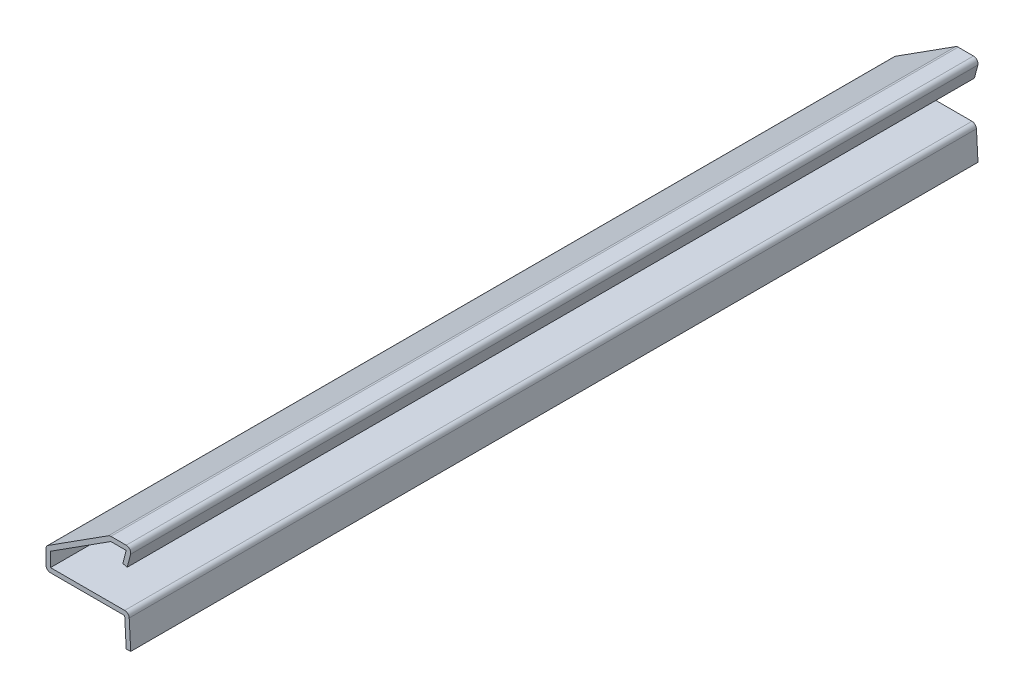
ISO-10303-21;
HEADER;
FILE_DESCRIPTION(('STEP AP214'),'2;1');
FILE_NAME('part.step','',(''),(''),'','','');
FILE_SCHEMA(('AUTOMOTIVE_DESIGN { 1 0 10303 214 1 1 1 1 }'));
ENDSEC;
DATA;
#1=APPLICATION_CONTEXT('core data for automotive mechanical design processes');
#2=APPLICATION_PROTOCOL_DEFINITION('international standard','automotive_design',2000,#1);
#3=PRODUCT_CONTEXT('',#1,'mechanical');
#4=PRODUCT('Part','Part','',(#3));
#5=PRODUCT_RELATED_PRODUCT_CATEGORY('part','',(#4));
#6=PRODUCT_DEFINITION_FORMATION('','',#4);
#7=PRODUCT_DEFINITION_CONTEXT('part definition',#1,'design');
#8=PRODUCT_DEFINITION('design','',#6,#7);
#9=PRODUCT_DEFINITION_SHAPE('','',#8);
#10=(LENGTH_UNIT() NAMED_UNIT(*) SI_UNIT(.MILLI.,.METRE.));
#11=(NAMED_UNIT(*) PLANE_ANGLE_UNIT() SI_UNIT($,.RADIAN.));
#12=(NAMED_UNIT(*) SI_UNIT($,.STERADIAN.) SOLID_ANGLE_UNIT());
#13=UNCERTAINTY_MEASURE_WITH_UNIT(LENGTH_MEASURE(1.E-05),#10,'distance_accuracy_value','');
#14=(GEOMETRIC_REPRESENTATION_CONTEXT(3) GLOBAL_UNCERTAINTY_ASSIGNED_CONTEXT((#13)) GLOBAL_UNIT_ASSIGNED_CONTEXT((#10,
#11,#12)) REPRESENTATION_CONTEXT('',''));
#15=CARTESIAN_POINT('',(0.,0.,0.));
#16=DIRECTION('',(0.,0.,1.));
#17=DIRECTION('',(1.,0.,0.));
#18=AXIS2_PLACEMENT_3D('',#15,#16,#17);
#19=CARTESIAN_POINT('',(-1.01450628516188,-0.0550726553476325,-190.5));
#20=DIRECTION('',(0.0542053694366462,-0.998529808230198,0.));
#21=DIRECTION('',(0.998529808230198,0.0542053694366462,0.));
#22=AXIS2_PLACEMENT_3D('',#19,#20,#21);
#23=PLANE('',#22);
#24=DIRECTION('',(0.998529808230199,0.0542053694366462,0.));
#25=VECTOR('',#24,1.);
#26=CARTESIAN_POINT('',(-1.01450628516188,-0.0550726553476325,0.));
#27=LINE('',#26,#25);
#28=CARTESIAN_POINT('',(-1.01450628516188,-0.0550726553476325,0.));
#29=VERTEX_POINT('',#28);
#30=CARTESIAN_POINT('',(0.,0.,0.));
#31=VERTEX_POINT('',#30);
#32=EDGE_CURVE('E232',#29,#31,#27,.T.);
#33=ORIENTED_EDGE('',*,*,#32,.F.);
#34=DIRECTION('',(0.,0.,1.));
#35=VECTOR('',#34,1.);
#36=CARTESIAN_POINT('',(-1.01450628516188,-0.0550726553476325,-190.5));
#37=LINE('',#36,#35);
#38=CARTESIAN_POINT('',(-1.01450628516188,-0.0550726553476325,-190.5));
#39=VERTEX_POINT('',#38);
#40=EDGE_CURVE('E193',#39,#29,#37,.T.);
#41=ORIENTED_EDGE('',*,*,#40,.F.);
#42=DIRECTION('',(0.998529808230199,0.0542053694366462,0.));
#43=VECTOR('',#42,1.);
#44=CARTESIAN_POINT('',(-1.01450628516188,-0.0550726553476325,-190.5));
#45=LINE('',#44,#43);
#46=CARTESIAN_POINT('',(0.,0.,-190.5));
#47=VERTEX_POINT('',#46);
#48=EDGE_CURVE('E187',#39,#47,#45,.T.);
#49=ORIENTED_EDGE('',*,*,#48,.T.);
#50=DIRECTION('',(0.,0.,1.));
#51=VECTOR('',#50,1.);
#52=CARTESIAN_POINT('',(0.,0.,-190.5));
#53=LINE('',#52,#51);
#54=EDGE_CURVE('E168',#47,#31,#53,.T.);
#55=ORIENTED_EDGE('',*,*,#54,.T.);
#56=EDGE_LOOP('',(#33,#41,#49,#55));
#57=FACE_BOUND('',#56,.T.);
#58=ADVANCED_FACE('F35',(#57),#23,.T.);
#59=CARTESIAN_POINT('',(-1.01450628516188,-0.0550726553476325,-190.5));
#60=DIRECTION('',(-0.998529808230198,-0.0542053694366462,0.));
#61=DIRECTION('',(0.0542053694366462,-0.998529808230198,0.));
#62=AXIS2_PLACEMENT_3D('',#59,#60,#61);
#63=PLANE('',#62);
#64=DIRECTION('',(0.0542053694366462,-0.998529808230198,0.));
#65=VECTOR('',#64,1.);
#66=CARTESIAN_POINT('',(-1.01450628516188,-0.0550726553476325,0.));
#67=LINE('',#66,#65);
#68=CARTESIAN_POINT('',(-1.35921717219366,6.29492734465237,0.));
#69=VERTEX_POINT('',#68);
#70=EDGE_CURVE('E194',#69,#29,#67,.T.);
#71=ORIENTED_EDGE('',*,*,#70,.F.);
#72=DIRECTION('',(0.,0.,1.));
#73=VECTOR('',#72,1.);
#74=CARTESIAN_POINT('',(-1.35921717219366,6.29492734465237,-190.5));
#75=LINE('',#74,#73);
#76=CARTESIAN_POINT('',(-1.35921717219366,6.29492734465237,-190.5));
#77=VERTEX_POINT('',#76);
#78=EDGE_CURVE('E270',#77,#69,#75,.T.);
#79=ORIENTED_EDGE('',*,*,#78,.F.);
#80=DIRECTION('',(0.0542053694366462,-0.998529808230198,0.));
#81=VECTOR('',#80,1.);
#82=CARTESIAN_POINT('',(-1.01450628516188,-0.0550726553476325,-190.5));
#83=LINE('',#82,#81);
#84=EDGE_CURVE('E181',#77,#39,#83,.T.);
#85=ORIENTED_EDGE('',*,*,#84,.T.);
#86=ORIENTED_EDGE('',*,*,#40,.T.);
#87=EDGE_LOOP('',(#71,#79,#85,#86));
#88=FACE_BOUND('',#87,.T.);
#89=ADVANCED_FACE('F367',(#88),#63,.T.);
#90=CARTESIAN_POINT('',(-1.35921717219366,6.29492734465237,-190.5));
#91=DIRECTION('',(0.,-1.,0.));
#92=DIRECTION('',(0.,0.,-1.));
#93=AXIS2_PLACEMENT_3D('',#90,#91,#92);
#94=PLANE('',#93);
#95=DIRECTION('',(1.,0.,0.));
#96=VECTOR('',#95,1.);
#97=CARTESIAN_POINT('',(-1.35921717219366,6.29492734465237,0.));
#98=LINE('',#97,#96);
#99=CARTESIAN_POINT('',(-18.034,6.29492734465237,0.));
#100=VERTEX_POINT('',#99);
#101=EDGE_CURVE('E197',#100,#69,#98,.T.);
#102=ORIENTED_EDGE('',*,*,#101,.F.);
#103=DIRECTION('',(0.,0.,1.));
#104=VECTOR('',#103,1.);
#105=CARTESIAN_POINT('',(-18.034,6.29492734465237,-190.5));
#106=LINE('',#105,#104);
#107=CARTESIAN_POINT('',(-18.034,6.29492734465237,-190.5));
#108=VERTEX_POINT('',#107);
#109=EDGE_CURVE('E310',#100,#108,#106,.F.);
#110=ORIENTED_EDGE('',*,*,#109,.T.);
#111=DIRECTION('',(1.,0.,0.));
#112=VECTOR('',#111,1.);
#113=CARTESIAN_POINT('',(-1.35921717219366,6.29492734465237,-190.5));
#114=LINE('',#113,#112);
#115=EDGE_CURVE('E229',#108,#77,#114,.T.);
#116=ORIENTED_EDGE('',*,*,#115,.T.);
#117=ORIENTED_EDGE('',*,*,#78,.T.);
#118=EDGE_LOOP('',(#102,#110,#116,#117));
#119=FACE_BOUND('',#118,.T.);
#120=ADVANCED_FACE('F378',(#119),#94,.T.);
#121=CARTESIAN_POINT('',(-19.05,6.29492734465237,-190.5));
#122=DIRECTION('',(-1.,0.,0.));
#123=DIRECTION('',(0.,0.,1.));
#124=AXIS2_PLACEMENT_3D('',#121,#122,#123);
#125=PLANE('',#124);
#126=DIRECTION('',(0.,-1.,0.));
#127=VECTOR('',#126,1.);
#128=CARTESIAN_POINT('',(-19.05,6.29492734465237,-190.5));
#129=LINE('',#128,#127);
#130=CARTESIAN_POINT('',(-19.05,10.5008845939242,-190.5));
#131=VERTEX_POINT('',#130);
#132=CARTESIAN_POINT('',(-19.05,7.31092734465237,-190.5));
#133=VERTEX_POINT('',#132);
#134=EDGE_CURVE('E226',#131,#133,#129,.T.);
#135=ORIENTED_EDGE('',*,*,#134,.T.);
#136=DIRECTION('',(0.,0.,1.));
#137=VECTOR('',#136,1.);
#138=CARTESIAN_POINT('',(-19.05,7.31092734465237,-190.5));
#139=LINE('',#138,#137);
#140=CARTESIAN_POINT('',(-19.05,7.31092734465237,0.));
#141=VERTEX_POINT('',#140);
#142=EDGE_CURVE('E307',#133,#141,#139,.T.);
#143=ORIENTED_EDGE('',*,*,#142,.T.);
#144=DIRECTION('',(0.,-1.,0.));
#145=VECTOR('',#144,1.);
#146=CARTESIAN_POINT('',(-19.05,6.29492734465237,0.));
#147=LINE('',#146,#145);
#148=CARTESIAN_POINT('',(-19.05,10.5008845939242,0.));
#149=VERTEX_POINT('',#148);
#150=EDGE_CURVE('E264',#149,#141,#147,.T.);
#151=ORIENTED_EDGE('',*,*,#150,.F.);
#152=DIRECTION('',(0.,0.,1.));
#153=VECTOR('',#152,1.);
#154=CARTESIAN_POINT('',(-19.05,10.5008845939242,-190.5));
#155=LINE('',#154,#153);
#156=EDGE_CURVE('E305',#149,#131,#155,.F.);
#157=ORIENTED_EDGE('',*,*,#156,.T.);
#158=EDGE_LOOP('',(#135,#143,#151,#157));
#159=FACE_BOUND('',#158,.T.);
#160=ADVANCED_FACE('F376',(#159),#125,.T.);
#161=CARTESIAN_POINT('',(-19.05,11.0574273446524,-190.5));
#162=DIRECTION('',(-0.538389277102201,0.84269625981214,0.));
#163=DIRECTION('',(-0.84269625981214,-0.538389277102201,0.));
#164=AXIS2_PLACEMENT_3D('',#161,#162,#163);
#165=PLANE('',#164);
#166=DIRECTION('',(-0.84269625981214,-0.538389277102201,0.));
#167=VECTOR('',#166,1.);
#168=CARTESIAN_POINT('',(-19.05,11.0574273446524,-190.5));
#169=LINE('',#168,#167);
#170=CARTESIAN_POINT('',(-5.01265398265701,20.0257317446215,-190.5));
#171=VERTEX_POINT('',#170);
#172=CARTESIAN_POINT('',(-18.5810035055358,11.3570639938934,-190.5));
#173=VERTEX_POINT('',#172);
#174=EDGE_CURVE('E224',#171,#173,#169,.T.);
#175=ORIENTED_EDGE('',*,*,#174,.T.);
#176=DIRECTION('',(0.,0.,1.));
#177=VECTOR('',#176,1.);
#178=CARTESIAN_POINT('',(-18.5810035055358,11.3570639938934,-190.5));
#179=LINE('',#178,#177);
#180=CARTESIAN_POINT('',(-18.5810035055358,11.3570639938934,0.));
#181=VERTEX_POINT('',#180);
#182=EDGE_CURVE('E43',#173,#181,#179,.T.);
#183=ORIENTED_EDGE('',*,*,#182,.T.);
#184=DIRECTION('',(-0.84269625981214,-0.538389277102201,0.));
#185=VECTOR('',#184,1.);
#186=CARTESIAN_POINT('',(-19.05,11.0574273446524,0.));
#187=LINE('',#186,#185);
#188=CARTESIAN_POINT('',(-5.01265398265701,20.0257317446215,0.));
#189=VERTEX_POINT('',#188);
#190=EDGE_CURVE('E261',#189,#181,#187,.T.);
#191=ORIENTED_EDGE('',*,*,#190,.F.);
#192=DIRECTION('',(0.,0.,1.));
#193=VECTOR('',#192,1.);
#194=CARTESIAN_POINT('',(-5.012653982657,20.0257317446215,-190.5));
#195=LINE('',#194,#193);
#196=EDGE_CURVE('E312',#189,#171,#195,.F.);
#197=ORIENTED_EDGE('',*,*,#196,.T.);
#198=EDGE_LOOP('',(#175,#183,#191,#197));
#199=FACE_BOUND('',#198,.T.);
#200=ADVANCED_FACE('F317',(#199),#165,.T.);
#201=CARTESIAN_POINT('',(-4.7625,20.1855523446524,-190.5));
#202=DIRECTION('',(0.,1.,0.));
#203=DIRECTION('',(-1.,0.,0.));
#204=AXIS2_PLACEMENT_3D('',#201,#202,#203);
#205=PLANE('',#204);
#206=DIRECTION('',(-1.,0.,0.));
#207=VECTOR('',#206,1.);
#208=CARTESIAN_POINT('',(-4.7625,20.1855523446524,-190.5));
#209=LINE('',#208,#207);
#210=CARTESIAN_POINT('',(-1.016,20.1855523446524,-190.5));
#211=VERTEX_POINT('',#210);
#212=CARTESIAN_POINT('',(-4.46565047712117,20.1855523446524,-190.5));
#213=VERTEX_POINT('',#212);
#214=EDGE_CURVE('E222',#211,#213,#209,.T.);
#215=ORIENTED_EDGE('',*,*,#214,.T.);
#216=DIRECTION('',(0.,0.,1.));
#217=VECTOR('',#216,1.);
#218=CARTESIAN_POINT('',(-4.46565047712117,20.1855523446524,-190.5));
#219=LINE('',#218,#217);
#220=CARTESIAN_POINT('',(-4.46565047712117,20.1855523446524,0.));
#221=VERTEX_POINT('',#220);
#222=EDGE_CURVE('E11',#213,#221,#219,.T.);
#223=ORIENTED_EDGE('',*,*,#222,.T.);
#224=DIRECTION('',(-1.,0.,0.));
#225=VECTOR('',#224,1.);
#226=CARTESIAN_POINT('',(-4.7625,20.1855523446524,0.));
#227=LINE('',#226,#225);
#228=CARTESIAN_POINT('',(-1.016,20.1855523446524,0.));
#229=VERTEX_POINT('',#228);
#230=EDGE_CURVE('E258',#229,#221,#227,.T.);
#231=ORIENTED_EDGE('',*,*,#230,.F.);
#232=DIRECTION('',(0.,0.,1.));
#233=VECTOR('',#232,1.);
#234=CARTESIAN_POINT('',(-1.016,20.1855523446524,-190.5));
#235=LINE('',#234,#233);
#236=EDGE_CURVE('E273',#211,#229,#235,.T.);
#237=ORIENTED_EDGE('',*,*,#236,.F.);
#238=EDGE_LOOP('',(#215,#223,#231,#237));
#239=FACE_BOUND('',#238,.T.);
#240=ADVANCED_FACE('F327',(#239),#205,.T.);
#241=CARTESIAN_POINT('',(-1.016,19.1695523446524,-190.5));
#242=DIRECTION('',(0.,0.,1.));
#243=DIRECTION('',(1.,0.,0.));
#244=AXIS2_PLACEMENT_3D('',#241,#242,#243);
#245=CYLINDRICAL_SURFACE('',#244,1.016);
#246=CARTESIAN_POINT('',(-1.016,19.1695523446524,0.));
#247=DIRECTION('',(0.,0.,1.));
#248=DIRECTION('',(-1.,0.,0.));
#249=AXIS2_PLACEMENT_3D('',#246,#247,#248);
#250=CIRCLE('',#249,1.016);
#251=CARTESIAN_POINT('',(-0.0328589909443715,18.9132522152863,0.));
#252=VERTEX_POINT('',#251);
#253=EDGE_CURVE('E255',#252,#229,#250,.T.);
#254=ORIENTED_EDGE('',*,*,#253,.F.);
#255=DIRECTION('',(0.,0.,1.));
#256=VECTOR('',#255,1.);
#257=CARTESIAN_POINT('',(-0.0328589909443715,18.9132522152863,-190.5));
#258=LINE('',#257,#256);
#259=CARTESIAN_POINT('',(-0.0328589909443715,18.9132522152863,-190.5));
#260=VERTEX_POINT('',#259);
#261=EDGE_CURVE('E275',#260,#252,#258,.T.);
#262=ORIENTED_EDGE('',*,*,#261,.F.);
#263=CARTESIAN_POINT('',(-1.016,19.1695523446524,-190.5));
#264=DIRECTION('',(0.,0.,1.));
#265=DIRECTION('',(-1.,0.,0.));
#266=AXIS2_PLACEMENT_3D('',#263,#264,#265);
#267=CIRCLE('',#266,1.016);
#268=EDGE_CURVE('E219',#260,#211,#267,.T.);
#269=ORIENTED_EDGE('',*,*,#268,.T.);
#270=ORIENTED_EDGE('',*,*,#236,.T.);
#271=EDGE_LOOP('',(#254,#262,#269,#270));
#272=FACE_BOUND('',#271,.T.);
#273=ADVANCED_FACE('F332',(#272),#245,.T.);
#274=CARTESIAN_POINT('',(-0.0328589909443736,18.9132522152863,-190.5));
#275=DIRECTION('',(0.967658473479948,-0.252263906856403,0.));
#276=DIRECTION('',(0.252263906856403,0.967658473479948,0.));
#277=AXIS2_PLACEMENT_3D('',#274,#275,#276);
#278=PLANE('',#277);
#279=DIRECTION('',(0.252263906856403,0.967658473479948,0.));
#280=VECTOR('',#279,1.);
#281=CARTESIAN_POINT('',(-0.0328589909443736,18.9132522152863,0.));
#282=LINE('',#281,#280);
#283=CARTESIAN_POINT('',(-0.79375,15.9945523446524,0.));
#284=VERTEX_POINT('',#283);
#285=EDGE_CURVE('E252',#284,#252,#282,.T.);
#286=ORIENTED_EDGE('',*,*,#285,.F.);
#287=DIRECTION('',(0.,0.,1.));
#288=VECTOR('',#287,1.);
#289=CARTESIAN_POINT('',(-0.79375,15.9945523446524,-190.5));
#290=LINE('',#289,#288);
#291=CARTESIAN_POINT('',(-0.79375,15.9945523446524,-190.5));
#292=VERTEX_POINT('',#291);
#293=EDGE_CURVE('E277',#292,#284,#290,.T.);
#294=ORIENTED_EDGE('',*,*,#293,.F.);
#295=DIRECTION('',(0.252263906856403,0.967658473479948,0.));
#296=VECTOR('',#295,1.);
#297=CARTESIAN_POINT('',(-0.0328589909443736,18.9132522152863,-190.5));
#298=LINE('',#297,#296);
#299=EDGE_CURVE('E216',#292,#260,#298,.T.);
#300=ORIENTED_EDGE('',*,*,#299,.T.);
#301=ORIENTED_EDGE('',*,*,#261,.T.);
#302=EDGE_LOOP('',(#286,#294,#300,#301));
#303=FACE_BOUND('',#302,.T.);
#304=ADVANCED_FACE('F335',(#303),#278,.T.);
#305=CARTESIAN_POINT('',(-0.79375,15.9945523446524,-190.5));
#306=DIRECTION('',(-0.252263906856403,-0.967658473479948,0.));
#307=DIRECTION('',(0.967658473479948,-0.252263906856403,0.));
#308=AXIS2_PLACEMENT_3D('',#305,#306,#307);
#309=PLANE('',#308);
#310=DIRECTION('',(0.967658473479948,-0.252263906856403,0.));
#311=VECTOR('',#310,1.);
#312=CARTESIAN_POINT('',(-0.79375,15.9945523446524,0.));
#313=LINE('',#312,#311);
#314=CARTESIAN_POINT('',(-1.77689100905563,16.2508524740185,0.));
#315=VERTEX_POINT('',#314);
#316=EDGE_CURVE('E249',#315,#284,#313,.T.);
#317=ORIENTED_EDGE('',*,*,#316,.F.);
#318=DIRECTION('',(0.,0.,1.));
#319=VECTOR('',#318,1.);
#320=CARTESIAN_POINT('',(-1.77689100905563,16.2508524740185,-190.5));
#321=LINE('',#320,#319);
#322=CARTESIAN_POINT('',(-1.77689100905563,16.2508524740185,-190.5));
#323=VERTEX_POINT('',#322);
#324=EDGE_CURVE('E279',#323,#315,#321,.T.);
#325=ORIENTED_EDGE('',*,*,#324,.F.);
#326=DIRECTION('',(0.967658473479948,-0.252263906856403,0.));
#327=VECTOR('',#326,1.);
#328=CARTESIAN_POINT('',(-0.79375,15.9945523446524,-190.5));
#329=LINE('',#328,#327);
#330=EDGE_CURVE('E213',#323,#292,#329,.T.);
#331=ORIENTED_EDGE('',*,*,#330,.T.);
#332=ORIENTED_EDGE('',*,*,#293,.T.);
#333=EDGE_LOOP('',(#317,#325,#331,#332));
#334=FACE_BOUND('',#333,.T.);
#335=ADVANCED_FACE('F340',(#334),#309,.T.);
#336=CARTESIAN_POINT('',(-1.016,19.1695523446524,-190.5));
#337=DIRECTION('',(-0.967658473479949,0.252263906856402,0.));
#338=DIRECTION('',(-0.252263906856402,-0.967658473479949,0.));
#339=AXIS2_PLACEMENT_3D('',#336,#337,#338);
#340=PLANE('',#339);
#341=DIRECTION('',(-0.252263906856402,-0.967658473479949,0.));
#342=VECTOR('',#341,1.);
#343=CARTESIAN_POINT('',(-1.016,19.1695523446524,0.));
#344=LINE('',#343,#342);
#345=CARTESIAN_POINT('',(-1.016,19.1695523446524,0.));
#346=VERTEX_POINT('',#345);
#347=EDGE_CURVE('E246',#346,#315,#344,.T.);
#348=ORIENTED_EDGE('',*,*,#347,.F.);
#349=DIRECTION('',(0.,0.,1.));
#350=VECTOR('',#349,1.);
#351=CARTESIAN_POINT('',(-1.016,19.1695523446524,-190.5));
#352=LINE('',#351,#350);
#353=CARTESIAN_POINT('',(-1.016,19.1695523446524,-190.5));
#354=VERTEX_POINT('',#353);
#355=EDGE_CURVE('E281',#354,#346,#352,.T.);
#356=ORIENTED_EDGE('',*,*,#355,.F.);
#357=DIRECTION('',(-0.252263906856402,-0.967658473479949,0.));
#358=VECTOR('',#357,1.);
#359=CARTESIAN_POINT('',(-1.016,19.1695523446524,-190.5));
#360=LINE('',#359,#358);
#361=EDGE_CURVE('E210',#354,#323,#360,.T.);
#362=ORIENTED_EDGE('',*,*,#361,.T.);
#363=ORIENTED_EDGE('',*,*,#324,.T.);
#364=EDGE_LOOP('',(#348,#356,#362,#363));
#365=FACE_BOUND('',#364,.T.);
#366=ADVANCED_FACE('F343',(#365),#340,.T.);
#367=CARTESIAN_POINT('',(-4.46565047712117,19.1695523446524,-190.5));
#368=DIRECTION('',(0.,-1.,0.));
#369=DIRECTION('',(0.,0.,-1.));
#370=AXIS2_PLACEMENT_3D('',#367,#368,#369);
#371=PLANE('',#370);
#372=DIRECTION('',(1.,0.,0.));
#373=VECTOR('',#372,1.);
#374=CARTESIAN_POINT('',(-4.46565047712117,19.1695523446524,0.));
#375=LINE('',#374,#373);
#376=CARTESIAN_POINT('',(-4.46565047712117,19.1695523446524,0.));
#377=VERTEX_POINT('',#376);
#378=EDGE_CURVE('E243',#377,#346,#375,.T.);
#379=ORIENTED_EDGE('',*,*,#378,.F.);
#380=DIRECTION('',(0.,0.,1.));
#381=VECTOR('',#380,1.);
#382=CARTESIAN_POINT('',(-4.46565047712117,19.1695523446524,-190.5));
#383=LINE('',#382,#381);
#384=CARTESIAN_POINT('',(-4.46565047712117,19.1695523446524,-190.5));
#385=VERTEX_POINT('',#384);
#386=EDGE_CURVE('E283',#385,#377,#383,.T.);
#387=ORIENTED_EDGE('',*,*,#386,.F.);
#388=DIRECTION('',(1.,0.,0.));
#389=VECTOR('',#388,1.);
#390=CARTESIAN_POINT('',(-4.46565047712117,19.1695523446524,-190.5));
#391=LINE('',#390,#389);
#392=EDGE_CURVE('E207',#385,#354,#391,.T.);
#393=ORIENTED_EDGE('',*,*,#392,.T.);
#394=ORIENTED_EDGE('',*,*,#355,.T.);
#395=EDGE_LOOP('',(#379,#387,#393,#394));
#396=FACE_BOUND('',#395,.T.);
#397=ADVANCED_FACE('F348',(#396),#371,.T.);
#398=CARTESIAN_POINT('',(-18.034,10.5008845939242,-190.5));
#399=DIRECTION('',(0.538389277102201,-0.84269625981214,0.));
#400=DIRECTION('',(0.84269625981214,0.538389277102201,0.));
#401=AXIS2_PLACEMENT_3D('',#398,#399,#400);
#402=PLANE('',#401);
#403=DIRECTION('',(0.84269625981214,0.538389277102201,0.));
#404=VECTOR('',#403,1.);
#405=CARTESIAN_POINT('',(-18.034,10.5008845939242,0.));
#406=LINE('',#405,#404);
#407=CARTESIAN_POINT('',(-18.034,10.5008845939242,0.));
#408=VERTEX_POINT('',#407);
#409=EDGE_CURVE('E240',#408,#377,#406,.T.);
#410=ORIENTED_EDGE('',*,*,#409,.F.);
#411=DIRECTION('',(0.,0.,1.));
#412=VECTOR('',#411,1.);
#413=CARTESIAN_POINT('',(-18.034,10.5008845939242,-190.5));
#414=LINE('',#413,#412);
#415=CARTESIAN_POINT('',(-18.034,10.5008845939242,-190.5));
#416=VERTEX_POINT('',#415);
#417=EDGE_CURVE('E285',#416,#408,#414,.T.);
#418=ORIENTED_EDGE('',*,*,#417,.F.);
#419=DIRECTION('',(0.84269625981214,0.538389277102201,0.));
#420=VECTOR('',#419,1.);
#421=CARTESIAN_POINT('',(-18.034,10.5008845939242,-190.5));
#422=LINE('',#421,#420);
#423=EDGE_CURVE('E204',#416,#385,#422,.T.);
#424=ORIENTED_EDGE('',*,*,#423,.T.);
#425=ORIENTED_EDGE('',*,*,#386,.T.);
#426=EDGE_LOOP('',(#410,#418,#424,#425));
#427=FACE_BOUND('',#426,.T.);
#428=ADVANCED_FACE('F351',(#427),#402,.T.);
#429=CARTESIAN_POINT('',(-18.034,7.31092734465237,-190.5));
#430=DIRECTION('',(1.,0.,0.));
#431=DIRECTION('',(0.,0.,-1.));
#432=AXIS2_PLACEMENT_3D('',#429,#430,#431);
#433=PLANE('',#432);
#434=DIRECTION('',(0.,1.,0.));
#435=VECTOR('',#434,1.);
#436=CARTESIAN_POINT('',(-18.034,7.31092734465237,0.));
#437=LINE('',#436,#435);
#438=CARTESIAN_POINT('',(-18.034,7.31092734465237,0.));
#439=VERTEX_POINT('',#438);
#440=EDGE_CURVE('E237',#439,#408,#437,.T.);
#441=ORIENTED_EDGE('',*,*,#440,.F.);
#442=DIRECTION('',(0.,0.,1.));
#443=VECTOR('',#442,1.);
#444=CARTESIAN_POINT('',(-18.034,7.31092734465237,-190.5));
#445=LINE('',#444,#443);
#446=CARTESIAN_POINT('',(-18.034,7.31092734465237,-190.5));
#447=VERTEX_POINT('',#446);
#448=EDGE_CURVE('E180',#447,#439,#445,.T.);
#449=ORIENTED_EDGE('',*,*,#448,.F.);
#450=DIRECTION('',(0.,1.,0.));
#451=VECTOR('',#450,1.);
#452=CARTESIAN_POINT('',(-18.034,7.31092734465237,-190.5));
#453=LINE('',#452,#451);
#454=EDGE_CURVE('E201',#447,#416,#453,.T.);
#455=ORIENTED_EDGE('',*,*,#454,.T.);
#456=ORIENTED_EDGE('',*,*,#417,.T.);
#457=EDGE_LOOP('',(#441,#449,#455,#456));
#458=FACE_BOUND('',#457,.T.);
#459=ADVANCED_FACE('F356',(#458),#433,.T.);
#460=CARTESIAN_POINT('',(-0.396875,7.31092734465237,-190.5));
#461=DIRECTION('',(0.,1.,0.));
#462=DIRECTION('',(0.,0.,1.));
#463=AXIS2_PLACEMENT_3D('',#460,#461,#462);
#464=PLANE('',#463);
#465=DIRECTION('',(-1.,0.,0.));
#466=VECTOR('',#465,1.);
#467=CARTESIAN_POINT('',(-0.396875,7.31092734465237,0.));
#468=LINE('',#467,#466);
#469=CARTESIAN_POINT('',(-1.35921717219366,7.31092734465237,0.));
#470=VERTEX_POINT('',#469);
#471=EDGE_CURVE('E235',#470,#439,#468,.T.);
#472=ORIENTED_EDGE('',*,*,#471,.F.);
#473=DIRECTION('',(0.,0.,1.));
#474=VECTOR('',#473,1.);
#475=CARTESIAN_POINT('',(-1.35921717219366,7.31092734465237,-190.5));
#476=LINE('',#475,#474);
#477=CARTESIAN_POINT('',(-1.35921717219366,7.31092734465237,-190.5));
#478=VERTEX_POINT('',#477);
#479=EDGE_CURVE('E298',#470,#478,#476,.F.);
#480=ORIENTED_EDGE('',*,*,#479,.T.);
#481=DIRECTION('',(-1.,0.,0.));
#482=VECTOR('',#481,1.);
#483=CARTESIAN_POINT('',(-0.396875,7.31092734465237,-190.5));
#484=LINE('',#483,#482);
#485=EDGE_CURVE('E191',#478,#447,#484,.T.);
#486=ORIENTED_EDGE('',*,*,#485,.T.);
#487=ORIENTED_EDGE('',*,*,#448,.T.);
#488=EDGE_LOOP('',(#472,#480,#486,#487));
#489=FACE_BOUND('',#488,.T.);
#490=ADVANCED_FACE('F359',(#489),#464,.T.);
#491=CARTESIAN_POINT('',(0.,0.,-190.5));
#492=DIRECTION('',(0.998529808230198,0.0542053694366462,0.));
#493=DIRECTION('',(-0.0542053694366462,0.998529808230198,0.));
#494=AXIS2_PLACEMENT_3D('',#491,#492,#493);
#495=PLANE('',#494);
#496=DIRECTION('',(-0.0542053694366462,0.998529808230198,0.));
#497=VECTOR('',#496,1.);
#498=CARTESIAN_POINT('',(0.,0.,-190.5));
#499=LINE('',#498,#497);
#500=CARTESIAN_POINT('',(-0.344710887031779,6.35,-190.5));
#501=VERTEX_POINT('',#500);
#502=EDGE_CURVE('E172',#47,#501,#499,.T.);
#503=ORIENTED_EDGE('',*,*,#502,.T.);
#504=DIRECTION('',(0.,0.,1.));
#505=VECTOR('',#504,1.);
#506=CARTESIAN_POINT('',(-0.344710887031778,6.35,-190.5));
#507=LINE('',#506,#505);
#508=CARTESIAN_POINT('',(-0.344710887031779,6.35,0.));
#509=VERTEX_POINT('',#508);
#510=EDGE_CURVE('E269',#501,#509,#507,.T.);
#511=ORIENTED_EDGE('',*,*,#510,.T.);
#512=DIRECTION('',(-0.0542053694366462,0.998529808230198,0.));
#513=VECTOR('',#512,1.);
#514=CARTESIAN_POINT('',(0.,0.,0.));
#515=LINE('',#514,#513);
#516=EDGE_CURVE('E175',#31,#509,#515,.T.);
#517=ORIENTED_EDGE('',*,*,#516,.F.);
#518=ORIENTED_EDGE('',*,*,#54,.F.);
#519=EDGE_LOOP('',(#503,#511,#517,#518));
#520=FACE_BOUND('',#519,.T.);
#521=ADVANCED_FACE('F170',(#520),#495,.T.);
#522=CARTESIAN_POINT('',(-1.016,19.1695523446524,-190.5));
#523=DIRECTION('',(0.,0.,-1.));
#524=DIRECTION('',(-1.,0.,0.));
#525=AXIS2_PLACEMENT_3D('',#522,#523,#524);
#526=PLANE('',#525);
#527=ORIENTED_EDGE('',*,*,#485,.F.);
#528=CARTESIAN_POINT('',(-1.35921717219366,6.29492734465237,-190.5));
#529=DIRECTION('',(0.,0.,-1.));
#530=DIRECTION('',(-1.,0.,0.));
#531=AXIS2_PLACEMENT_3D('',#528,#529,#530);
#532=CIRCLE('',#531,1.016);
#533=EDGE_CURVE('E190',#478,#501,#532,.T.);
#534=ORIENTED_EDGE('',*,*,#533,.T.);
#535=ORIENTED_EDGE('',*,*,#502,.F.);
#536=ORIENTED_EDGE('',*,*,#48,.F.);
#537=ORIENTED_EDGE('',*,*,#84,.F.);
#538=ORIENTED_EDGE('',*,*,#115,.F.);
#539=CARTESIAN_POINT('',(-18.034,7.31092734465237,-190.5));
#540=DIRECTION('',(0.,0.,-1.));
#541=DIRECTION('',(-1.,0.,0.));
#542=AXIS2_PLACEMENT_3D('',#539,#540,#541);
#543=CIRCLE('',#542,1.016);
#544=EDGE_CURVE('E302',#108,#133,#543,.T.);
#545=ORIENTED_EDGE('',*,*,#544,.T.);
#546=ORIENTED_EDGE('',*,*,#134,.F.);
#547=CARTESIAN_POINT('',(-18.034,10.5008845939242,-190.5));
#548=DIRECTION('',(0.,0.,-1.));
#549=DIRECTION('',(-1.,0.,0.));
#550=AXIS2_PLACEMENT_3D('',#547,#548,#549);
#551=CIRCLE('',#550,1.016);
#552=EDGE_CURVE('E56',#131,#173,#551,.T.);
#553=ORIENTED_EDGE('',*,*,#552,.T.);
#554=ORIENTED_EDGE('',*,*,#174,.F.);
#555=CARTESIAN_POINT('',(-4.46565047712117,19.1695523446524,-190.5));
#556=DIRECTION('',(0.,0.,-1.));
#557=DIRECTION('',(-1.,0.,0.));
#558=AXIS2_PLACEMENT_3D('',#555,#556,#557);
#559=CIRCLE('',#558,1.016);
#560=EDGE_CURVE('E50',#171,#213,#559,.T.);
#561=ORIENTED_EDGE('',*,*,#560,.T.);
#562=ORIENTED_EDGE('',*,*,#214,.F.);
#563=ORIENTED_EDGE('',*,*,#268,.F.);
#564=ORIENTED_EDGE('',*,*,#299,.F.);
#565=ORIENTED_EDGE('',*,*,#330,.F.);
#566=ORIENTED_EDGE('',*,*,#361,.F.);
#567=ORIENTED_EDGE('',*,*,#392,.F.);
#568=ORIENTED_EDGE('',*,*,#423,.F.);
#569=ORIENTED_EDGE('',*,*,#454,.F.);
#570=EDGE_LOOP('',(#527,#534,#535,#536,#537,#538,#545,#546,#553,#554,#561,#562,#563,#564,#565,
#566,#567,#568,#569));
#571=FACE_BOUND('',#570,.T.);
#572=ADVANCED_FACE('F185',(#571),#526,.T.);
#573=CARTESIAN_POINT('',(-1.016,19.1695523446524,0.));
#574=DIRECTION('',(0.,0.,-1.));
#575=DIRECTION('',(-1.,0.,0.));
#576=AXIS2_PLACEMENT_3D('',#573,#574,#575);
#577=PLANE('',#576);
#578=ORIENTED_EDGE('',*,*,#516,.T.);
#579=CARTESIAN_POINT('',(-1.35921717219366,6.29492734465237,0.));
#580=DIRECTION('',(0.,0.,-1.));
#581=DIRECTION('',(-1.,0.,0.));
#582=AXIS2_PLACEMENT_3D('',#579,#580,#581);
#583=CIRCLE('',#582,1.016);
#584=EDGE_CURVE('E296',#509,#470,#583,.F.);
#585=ORIENTED_EDGE('',*,*,#584,.T.);
#586=ORIENTED_EDGE('',*,*,#471,.T.);
#587=ORIENTED_EDGE('',*,*,#440,.T.);
#588=ORIENTED_EDGE('',*,*,#409,.T.);
#589=ORIENTED_EDGE('',*,*,#378,.T.);
#590=ORIENTED_EDGE('',*,*,#347,.T.);
#591=ORIENTED_EDGE('',*,*,#316,.T.);
#592=ORIENTED_EDGE('',*,*,#285,.T.);
#593=ORIENTED_EDGE('',*,*,#253,.T.);
#594=ORIENTED_EDGE('',*,*,#230,.T.);
#595=CARTESIAN_POINT('',(-4.46565047712117,19.1695523446524,0.));
#596=DIRECTION('',(0.,0.,-1.));
#597=DIRECTION('',(-1.,0.,0.));
#598=AXIS2_PLACEMENT_3D('',#595,#596,#597);
#599=CIRCLE('',#598,1.016);
#600=EDGE_CURVE('E290',#221,#189,#599,.F.);
#601=ORIENTED_EDGE('',*,*,#600,.T.);
#602=ORIENTED_EDGE('',*,*,#190,.T.);
#603=CARTESIAN_POINT('',(-18.034,10.5008845939242,0.));
#604=DIRECTION('',(0.,0.,-1.));
#605=DIRECTION('',(-1.,0.,0.));
#606=AXIS2_PLACEMENT_3D('',#603,#604,#605);
#607=CIRCLE('',#606,1.016);
#608=EDGE_CURVE('E292',#181,#149,#607,.F.);
#609=ORIENTED_EDGE('',*,*,#608,.T.);
#610=ORIENTED_EDGE('',*,*,#150,.T.);
#611=CARTESIAN_POINT('',(-18.034,7.31092734465237,0.));
#612=DIRECTION('',(0.,0.,-1.));
#613=DIRECTION('',(-1.,0.,0.));
#614=AXIS2_PLACEMENT_3D('',#611,#612,#613);
#615=CIRCLE('',#614,1.016);
#616=EDGE_CURVE('E294',#141,#100,#615,.F.);
#617=ORIENTED_EDGE('',*,*,#616,.T.);
#618=ORIENTED_EDGE('',*,*,#101,.T.);
#619=ORIENTED_EDGE('',*,*,#70,.T.);
#620=ORIENTED_EDGE('',*,*,#32,.T.);
#621=EDGE_LOOP('',(#578,#585,#586,#587,#588,#589,#590,#591,#592,#593,#594,#601,#602,#609,#610,
#617,#618,#619,#620));
#622=FACE_BOUND('',#621,.T.);
#623=ADVANCED_FACE('F321',(#622),#577,.F.);
#624=CARTESIAN_POINT('',(-1.35921717219366,6.29492734465237,-190.5));
#625=DIRECTION('',(0.,0.,1.));
#626=DIRECTION('',(1.,0.,0.));
#627=AXIS2_PLACEMENT_3D('',#624,#625,#626);
#628=CYLINDRICAL_SURFACE('',#627,1.016);
#629=ORIENTED_EDGE('',*,*,#533,.F.);
#630=ORIENTED_EDGE('',*,*,#479,.F.);
#631=ORIENTED_EDGE('',*,*,#584,.F.);
#632=ORIENTED_EDGE('',*,*,#510,.F.);
#633=EDGE_LOOP('',(#629,#630,#631,#632));
#634=FACE_BOUND('',#633,.T.);
#635=ADVANCED_FACE('F362',(#634),#628,.T.);
#636=CARTESIAN_POINT('',(-18.034,7.31092734465237,-190.5));
#637=DIRECTION('',(0.,0.,1.));
#638=DIRECTION('',(1.,0.,0.));
#639=AXIS2_PLACEMENT_3D('',#636,#637,#638);
#640=CYLINDRICAL_SURFACE('',#639,1.016);
#641=ORIENTED_EDGE('',*,*,#544,.F.);
#642=ORIENTED_EDGE('',*,*,#109,.F.);
#643=ORIENTED_EDGE('',*,*,#616,.F.);
#644=ORIENTED_EDGE('',*,*,#142,.F.);
#645=EDGE_LOOP('',(#641,#642,#643,#644));
#646=FACE_BOUND('',#645,.T.);
#647=ADVANCED_FACE('F374',(#646),#640,.T.);
#648=CARTESIAN_POINT('',(-18.034,10.5008845939242,-190.5));
#649=DIRECTION('',(0.,0.,1.));
#650=DIRECTION('',(1.,0.,0.));
#651=AXIS2_PLACEMENT_3D('',#648,#649,#650);
#652=CYLINDRICAL_SURFACE('',#651,1.016);
#653=ORIENTED_EDGE('',*,*,#552,.F.);
#654=ORIENTED_EDGE('',*,*,#156,.F.);
#655=ORIENTED_EDGE('',*,*,#608,.F.);
#656=ORIENTED_EDGE('',*,*,#182,.F.);
#657=EDGE_LOOP('',(#653,#654,#655,#656));
#658=FACE_BOUND('',#657,.T.);
#659=ADVANCED_FACE('F397',(#658),#652,.T.);
#660=CARTESIAN_POINT('',(-4.46565047712117,19.1695523446524,-190.5));
#661=DIRECTION('',(0.,0.,1.));
#662=DIRECTION('',(1.,0.,0.));
#663=AXIS2_PLACEMENT_3D('',#660,#661,#662);
#664=CYLINDRICAL_SURFACE('',#663,1.016);
#665=ORIENTED_EDGE('',*,*,#560,.F.);
#666=ORIENTED_EDGE('',*,*,#196,.F.);
#667=ORIENTED_EDGE('',*,*,#600,.F.);
#668=ORIENTED_EDGE('',*,*,#222,.F.);
#669=EDGE_LOOP('',(#665,#666,#667,#668));
#670=FACE_BOUND('',#669,.T.);
#671=ADVANCED_FACE('F37',(#670),#664,.T.);
#672=CLOSED_SHELL('',(#58,#89,#120,#160,#200,#240,#273,#304,#335,#366,#397,#428,#459,#490,#521,
#572,#623,#635,#647,#659,#671));
#673=MANIFOLD_SOLID_BREP('B2',#672);
#674=ADVANCED_BREP_SHAPE_REPRESENTATION('',(#18,#673),#14);
#675=SHAPE_DEFINITION_REPRESENTATION(#9,#674);
ENDSEC;
END-ISO-10303-21;
